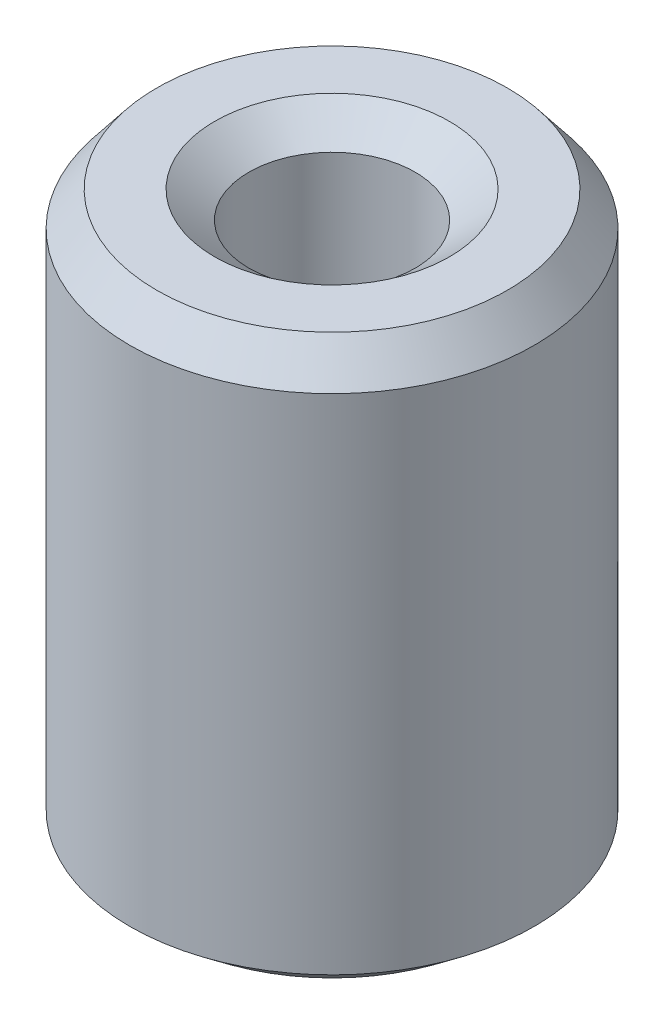
ISO-10303-21;
HEADER;
FILE_DESCRIPTION(('STEP AP214'),'2;1');
FILE_NAME('part.step','',(''),(''),'','','');
FILE_SCHEMA(('AUTOMOTIVE_DESIGN { 1 0 10303 214 1 1 1 1 }'));
ENDSEC;
DATA;
#1=APPLICATION_CONTEXT('core data for automotive mechanical design processes');
#2=APPLICATION_PROTOCOL_DEFINITION('international standard','automotive_design',2000,#1);
#3=PRODUCT_CONTEXT('',#1,'mechanical');
#4=PRODUCT('Part','Part','',(#3));
#5=PRODUCT_RELATED_PRODUCT_CATEGORY('part','',(#4));
#6=PRODUCT_DEFINITION_FORMATION('','',#4);
#7=PRODUCT_DEFINITION_CONTEXT('part definition',#1,'design');
#8=PRODUCT_DEFINITION('design','',#6,#7);
#9=PRODUCT_DEFINITION_SHAPE('','',#8);
#10=(LENGTH_UNIT() NAMED_UNIT(*) SI_UNIT(.MILLI.,.METRE.));
#11=(NAMED_UNIT(*) PLANE_ANGLE_UNIT() SI_UNIT($,.RADIAN.));
#12=(NAMED_UNIT(*) SI_UNIT($,.STERADIAN.) SOLID_ANGLE_UNIT());
#13=UNCERTAINTY_MEASURE_WITH_UNIT(LENGTH_MEASURE(1.E-05),#10,'distance_accuracy_value','');
#14=(GEOMETRIC_REPRESENTATION_CONTEXT(3) GLOBAL_UNCERTAINTY_ASSIGNED_CONTEXT((#13)) GLOBAL_UNIT_ASSIGNED_CONTEXT((#10,
#11,#12)) REPRESENTATION_CONTEXT('',''));
#15=CARTESIAN_POINT('',(0.,0.,0.));
#16=DIRECTION('',(0.,0.,1.));
#17=DIRECTION('',(1.,0.,0.));
#18=AXIS2_PLACEMENT_3D('',#15,#16,#17);
#19=CARTESIAN_POINT('',(0.,20.9358694637739,0.));
#20=DIRECTION('',(0.,-1.,0.));
#21=DIRECTION('',(0.,0.,-1.));
#22=AXIS2_PLACEMENT_3D('',#19,#20,#21);
#23=CYLINDRICAL_SURFACE('',#22,7.5);
#24=CARTESIAN_POINT('',(0.,0.997489416314189,0.));
#25=DIRECTION('',(0.,1.,0.));
#26=DIRECTION('',(0.,0.,1.));
#27=AXIS2_PLACEMENT_3D('',#24,#25,#26);
#28=CIRCLE('',#27,7.5);
#29=CARTESIAN_POINT('',(0.,0.997489416314189,7.5));
#30=VERTEX_POINT('',#29);
#31=EDGE_CURVE('E10',#30,#30,#28,.T.);
#32=ORIENTED_EDGE('',*,*,#31,.T.);
#33=EDGE_LOOP('',(#32));
#34=FACE_BOUND('',#33,.T.);
#35=CARTESIAN_POINT('',(0.,19.6668589784921,0.));
#36=DIRECTION('',(0.,1.,0.));
#37=DIRECTION('',(0.,0.,1.));
#38=AXIS2_PLACEMENT_3D('',#35,#36,#37);
#39=CIRCLE('',#38,7.5);
#40=CARTESIAN_POINT('',(0.,19.6668589784921,7.5));
#41=VERTEX_POINT('',#40);
#42=EDGE_CURVE('E50',#41,#41,#39,.F.);
#43=ORIENTED_EDGE('',*,*,#42,.T.);
#44=EDGE_LOOP('',(#43));
#45=FACE_BOUND('',#44,.T.);
#46=ADVANCED_FACE('F39',(#34,#45),#23,.T.);
#47=CARTESIAN_POINT('',(0.,20.9358694637739,0.));
#48=DIRECTION('',(0.,1.,0.));
#49=DIRECTION('',(0.,0.,1.));
#50=AXIS2_PLACEMENT_3D('',#47,#48,#49);
#51=PLANE('',#50);
#52=CARTESIAN_POINT('',(0.,20.9358694637739,0.));
#53=DIRECTION('',(0.,1.,0.));
#54=DIRECTION('',(0.,0.,1.));
#55=AXIS2_PLACEMENT_3D('',#52,#53,#54);
#56=CIRCLE('',#55,4.35522377582621);
#57=CARTESIAN_POINT('',(0.,20.9358694637739,4.35522377582621));
#58=VERTEX_POINT('',#57);
#59=EDGE_CURVE('E58',#58,#58,#56,.F.);
#60=ORIENTED_EDGE('',*,*,#59,.T.);
#61=EDGE_LOOP('',(#60));
#62=FACE_BOUND('',#61,.T.);
#63=CARTESIAN_POINT('',(0.,20.9358694637739,0.));
#64=DIRECTION('',(0.,1.,0.));
#65=DIRECTION('',(0.,0.,1.));
#66=AXIS2_PLACEMENT_3D('',#63,#64,#65);
#67=CIRCLE('',#66,6.50251058368582);
#68=CARTESIAN_POINT('',(0.,20.9358694637739,6.50251058368582));
#69=VERTEX_POINT('',#68);
#70=EDGE_CURVE('E61',#69,#69,#67,.T.);
#71=ORIENTED_EDGE('',*,*,#70,.T.);
#72=EDGE_LOOP('',(#71));
#73=FACE_BOUND('',#72,.T.);
#74=ADVANCED_FACE('F88',(#62,#73),#51,.T.);
#75=CARTESIAN_POINT('',(0.,0.,0.));
#76=DIRECTION('',(0.,1.,0.));
#77=DIRECTION('',(0.,0.,1.));
#78=AXIS2_PLACEMENT_3D('',#75,#76,#77);
#79=PLANE('',#78);
#80=CARTESIAN_POINT('',(0.,0.,0.));
#81=DIRECTION('',(0.,1.,0.));
#82=DIRECTION('',(0.,0.,1.));
#83=AXIS2_PLACEMENT_3D('',#80,#81,#82);
#84=CIRCLE('',#83,4.08370270685863);
#85=CARTESIAN_POINT('',(0.,0.,4.08370270685863));
#86=VERTEX_POINT('',#85);
#87=EDGE_CURVE('E51',#86,#86,#84,.T.);
#88=ORIENTED_EDGE('',*,*,#87,.T.);
#89=EDGE_LOOP('',(#88));
#90=FACE_BOUND('',#89,.T.);
#91=CARTESIAN_POINT('',(0.,0.,0.));
#92=DIRECTION('',(0.,1.,0.));
#93=DIRECTION('',(0.,0.,1.));
#94=AXIS2_PLACEMENT_3D('',#91,#92,#93);
#95=CIRCLE('',#94,6.23098951471824);
#96=CARTESIAN_POINT('',(0.,0.,6.23098951471824));
#97=VERTEX_POINT('',#96);
#98=EDGE_CURVE('E54',#97,#97,#95,.F.);
#99=ORIENTED_EDGE('',*,*,#98,.T.);
#100=EDGE_LOOP('',(#99));
#101=FACE_BOUND('',#100,.T.);
#102=ADVANCED_FACE('F83',(#90,#101),#79,.F.);
#103=CARTESIAN_POINT('',(0.,20.9358694637739,0.));
#104=DIRECTION('',(0.,-1.,0.));
#105=DIRECTION('',(0.,0.,-1.));
#106=AXIS2_PLACEMENT_3D('',#103,#104,#105);
#107=CYLINDRICAL_SURFACE('',#106,3.08621329054444);
#108=CARTESIAN_POINT('',(0.,19.9383800474597,0.));
#109=DIRECTION('',(0.,1.,0.));
#110=DIRECTION('',(0.,0.,1.));
#111=AXIS2_PLACEMENT_3D('',#108,#109,#110);
#112=CIRCLE('',#111,3.08621329054444);
#113=CARTESIAN_POINT('',(0.,19.9383800474597,3.08621329054444));
#114=VERTEX_POINT('',#113);
#115=EDGE_CURVE('E67',#114,#114,#112,.T.);
#116=ORIENTED_EDGE('',*,*,#115,.T.);
#117=EDGE_LOOP('',(#116));
#118=FACE_BOUND('',#117,.T.);
#119=CARTESIAN_POINT('',(0.,1.26901048528176,0.));
#120=DIRECTION('',(0.,1.,0.));
#121=DIRECTION('',(0.,0.,1.));
#122=AXIS2_PLACEMENT_3D('',#119,#120,#121);
#123=CIRCLE('',#122,3.08621329054444);
#124=CARTESIAN_POINT('',(0.,1.26901048528176,3.08621329054444));
#125=VERTEX_POINT('',#124);
#126=EDGE_CURVE('E69',#125,#125,#123,.F.);
#127=ORIENTED_EDGE('',*,*,#126,.T.);
#128=EDGE_LOOP('',(#127));
#129=FACE_BOUND('',#128,.T.);
#130=ADVANCED_FACE('F71',(#118,#129),#107,.F.);
#131=CARTESIAN_POINT('',(0.,19.9383800474597,0.));
#132=DIRECTION('',(0.,1.,0.));
#133=DIRECTION('',(0.,0.,1.));
#134=AXIS2_PLACEMENT_3D('',#131,#132,#133);
#135=CONICAL_SURFACE('',#134,3.08621329054444,0.90462747968806);
#136=ORIENTED_EDGE('',*,*,#59,.F.);
#137=EDGE_LOOP('',(#136));
#138=FACE_BOUND('',#137,.T.);
#139=ORIENTED_EDGE('',*,*,#115,.F.);
#140=EDGE_LOOP('',(#139));
#141=FACE_BOUND('',#140,.T.);
#142=ADVANCED_FACE('F77',(#138,#141),#135,.F.);
#143=CARTESIAN_POINT('',(0.,0.,0.));
#144=DIRECTION('',(0.,-1.,0.));
#145=DIRECTION('',(0.,0.,-1.));
#146=AXIS2_PLACEMENT_3D('',#143,#144,#145);
#147=CONICAL_SURFACE('',#146,4.08370270685863,0.666168847106836);
#148=ORIENTED_EDGE('',*,*,#126,.F.);
#149=EDGE_LOOP('',(#148));
#150=FACE_BOUND('',#149,.T.);
#151=ORIENTED_EDGE('',*,*,#87,.F.);
#152=EDGE_LOOP('',(#151));
#153=FACE_BOUND('',#152,.T.);
#154=ADVANCED_FACE('F73',(#150,#153),#147,.F.);
#155=CARTESIAN_POINT('',(0.,0.997489416314189,0.));
#156=DIRECTION('',(0.,1.,0.));
#157=DIRECTION('',(0.,0.,1.));
#158=AXIS2_PLACEMENT_3D('',#155,#156,#157);
#159=CONICAL_SURFACE('',#158,7.5,0.904627479688062);
#160=ORIENTED_EDGE('',*,*,#98,.F.);
#161=EDGE_LOOP('',(#160));
#162=FACE_BOUND('',#161,.T.);
#163=ORIENTED_EDGE('',*,*,#31,.F.);
#164=EDGE_LOOP('',(#163));
#165=FACE_BOUND('',#164,.T.);
#166=ADVANCED_FACE('F76',(#162,#165),#159,.T.);
#167=CARTESIAN_POINT('',(0.,20.9358694637739,0.));
#168=DIRECTION('',(0.,-1.,0.));
#169=DIRECTION('',(0.,0.,-1.));
#170=AXIS2_PLACEMENT_3D('',#167,#168,#169);
#171=CONICAL_SURFACE('',#170,6.50251058368582,0.666168847106836);
#172=ORIENTED_EDGE('',*,*,#42,.F.);
#173=EDGE_LOOP('',(#172));
#174=FACE_BOUND('',#173,.T.);
#175=ORIENTED_EDGE('',*,*,#70,.F.);
#176=EDGE_LOOP('',(#175));
#177=FACE_BOUND('',#176,.T.);
#178=ADVANCED_FACE('F45',(#174,#177),#171,.T.);
#179=CLOSED_SHELL('',(#46,#74,#102,#130,#142,#154,#166,#178));
#180=MANIFOLD_SOLID_BREP('B2',#179);
#181=ADVANCED_BREP_SHAPE_REPRESENTATION('',(#18,#180),#14);
#182=SHAPE_DEFINITION_REPRESENTATION(#9,#181);
ENDSEC;
END-ISO-10303-21;
